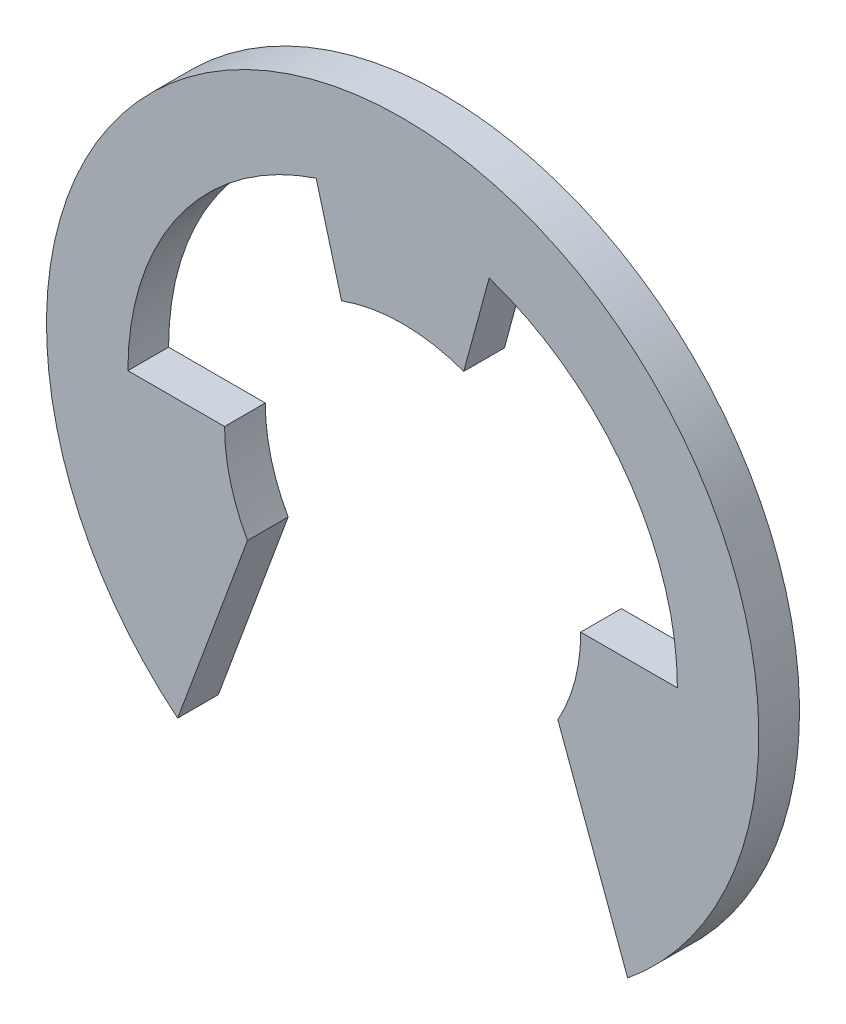
ISO-10303-21;
HEADER;
FILE_DESCRIPTION(('STEP AP214'),'2;1');
FILE_NAME('part.step','',(''),(''),'','','');
FILE_SCHEMA(('AUTOMOTIVE_DESIGN { 1 0 10303 214 1 1 1 1 }'));
ENDSEC;
DATA;
#1=APPLICATION_CONTEXT('core data for automotive mechanical design processes');
#2=APPLICATION_PROTOCOL_DEFINITION('international standard','automotive_design',2000,#1);
#3=PRODUCT_CONTEXT('',#1,'mechanical');
#4=PRODUCT('Part','Part','',(#3));
#5=PRODUCT_RELATED_PRODUCT_CATEGORY('part','',(#4));
#6=PRODUCT_DEFINITION_FORMATION('','',#4);
#7=PRODUCT_DEFINITION_CONTEXT('part definition',#1,'design');
#8=PRODUCT_DEFINITION('design','',#6,#7);
#9=PRODUCT_DEFINITION_SHAPE('','',#8);
#10=(LENGTH_UNIT() NAMED_UNIT(*) SI_UNIT(.MILLI.,.METRE.));
#11=(NAMED_UNIT(*) PLANE_ANGLE_UNIT() SI_UNIT($,.RADIAN.));
#12=(NAMED_UNIT(*) SI_UNIT($,.STERADIAN.) SOLID_ANGLE_UNIT());
#13=UNCERTAINTY_MEASURE_WITH_UNIT(LENGTH_MEASURE(1.E-05),#10,'distance_accuracy_value','');
#14=(GEOMETRIC_REPRESENTATION_CONTEXT(3) GLOBAL_UNCERTAINTY_ASSIGNED_CONTEXT((#13)) GLOBAL_UNIT_ASSIGNED_CONTEXT((#10,
#11,#12)) REPRESENTATION_CONTEXT('',''));
#15=CARTESIAN_POINT('',(0.,0.,0.));
#16=DIRECTION('',(0.,0.,1.));
#17=DIRECTION('',(1.,0.,0.));
#18=AXIS2_PLACEMENT_3D('',#15,#16,#17);
#19=CARTESIAN_POINT('',(-1.7,5.1254268114958,0.4));
#20=DIRECTION('',(0.965016494472312,0.262189178640864,0.));
#21=DIRECTION('',(0.,0.,-1.));
#22=AXIS2_PLACEMENT_3D('',#19,#20,#21);
#23=PLANE('',#22);
#24=DIRECTION('',(0.262189178640864,-0.965016494472312,0.));
#25=VECTOR('',#24,1.);
#26=CARTESIAN_POINT('',(-1.7,5.1254268114958,-0.4));
#27=LINE('',#26,#25);
#28=CARTESIAN_POINT('',(-1.7,5.1254268114958,-0.4));
#29=VERTEX_POINT('',#28);
#30=CARTESIAN_POINT('',(-1.20067611436934,3.28760959792719,-0.4));
#31=VERTEX_POINT('',#30);
#32=EDGE_CURVE('E173',#29,#31,#27,.T.);
#33=ORIENTED_EDGE('',*,*,#32,.T.);
#34=DIRECTION('',(0.,0.,-1.));
#35=VECTOR('',#34,1.);
#36=CARTESIAN_POINT('',(-1.20067611436934,3.28760959792719,0.4));
#37=LINE('',#36,#35);
#38=CARTESIAN_POINT('',(-1.20067611436934,3.28760959792719,0.4));
#39=VERTEX_POINT('',#38);
#40=EDGE_CURVE('E203',#39,#31,#37,.T.);
#41=ORIENTED_EDGE('',*,*,#40,.F.);
#42=DIRECTION('',(0.262189178640864,-0.965016494472312,0.));
#43=VECTOR('',#42,1.);
#44=CARTESIAN_POINT('',(-1.7,5.1254268114958,0.4));
#45=LINE('',#44,#43);
#46=CARTESIAN_POINT('',(-1.7,5.1254268114958,0.4));
#47=VERTEX_POINT('',#46);
#48=EDGE_CURVE('E236',#47,#39,#45,.T.);
#49=ORIENTED_EDGE('',*,*,#48,.F.);
#50=DIRECTION('',(0.,0.,-1.));
#51=VECTOR('',#50,1.);
#52=CARTESIAN_POINT('',(-1.7,5.1254268114958,0.4));
#53=LINE('',#52,#51);
#54=EDGE_CURVE('E9',#47,#29,#53,.T.);
#55=ORIENTED_EDGE('',*,*,#54,.T.);
#56=EDGE_LOOP('',(#33,#41,#49,#55));
#57=FACE_BOUND('',#56,.T.);
#58=ADVANCED_FACE('F14',(#57),#23,.F.);
#59=CARTESIAN_POINT('',(0.,0.,0.4));
#60=DIRECTION('',(0.,0.,1.));
#61=DIRECTION('',(-1.,0.,0.));
#62=AXIS2_PLACEMENT_3D('',#59,#60,#61);
#63=CYLINDRICAL_SURFACE('',#62,5.4);
#64=CARTESIAN_POINT('',(0.,0.,-0.4));
#65=DIRECTION('',(0.,0.,1.));
#66=DIRECTION('',(1.,0.,0.));
#67=AXIS2_PLACEMENT_3D('',#64,#65,#66);
#68=CIRCLE('',#67,5.4);
#69=CARTESIAN_POINT('',(-5.4,0.,-0.4));
#70=VERTEX_POINT('',#69);
#71=EDGE_CURVE('E153',#29,#70,#68,.T.);
#72=ORIENTED_EDGE('',*,*,#71,.F.);
#73=ORIENTED_EDGE('',*,*,#54,.F.);
#74=CARTESIAN_POINT('',(0.,0.,0.4));
#75=DIRECTION('',(0.,0.,1.));
#76=DIRECTION('',(1.,0.,0.));
#77=AXIS2_PLACEMENT_3D('',#74,#75,#76);
#78=CIRCLE('',#77,5.4);
#79=CARTESIAN_POINT('',(-5.4,0.,0.4));
#80=VERTEX_POINT('',#79);
#81=EDGE_CURVE('E156',#47,#80,#78,.T.);
#82=ORIENTED_EDGE('',*,*,#81,.T.);
#83=DIRECTION('',(0.,0.,-1.));
#84=VECTOR('',#83,1.);
#85=CARTESIAN_POINT('',(-5.4,0.,0.4));
#86=LINE('',#85,#84);
#87=EDGE_CURVE('E25',#80,#70,#86,.T.);
#88=ORIENTED_EDGE('',*,*,#87,.T.);
#89=EDGE_LOOP('',(#72,#73,#82,#88));
#90=FACE_BOUND('',#89,.T.);
#91=ADVANCED_FACE('F151',(#90),#63,.F.);
#92=CARTESIAN_POINT('',(-3.5,0.,0.4));
#93=DIRECTION('',(0.,-1.,0.));
#94=DIRECTION('',(0.,0.,-1.));
#95=AXIS2_PLACEMENT_3D('',#92,#93,#94);
#96=PLANE('',#95);
#97=DIRECTION('',(-1.,0.,0.));
#98=VECTOR('',#97,1.);
#99=CARTESIAN_POINT('',(-3.5,0.,-0.4));
#100=LINE('',#99,#98);
#101=CARTESIAN_POINT('',(-3.5,0.,-0.4));
#102=VERTEX_POINT('',#101);
#103=EDGE_CURVE('E164',#102,#70,#100,.T.);
#104=ORIENTED_EDGE('',*,*,#103,.T.);
#105=ORIENTED_EDGE('',*,*,#87,.F.);
#106=DIRECTION('',(-1.,0.,0.));
#107=VECTOR('',#106,1.);
#108=CARTESIAN_POINT('',(-3.5,0.,0.4));
#109=LINE('',#108,#107);
#110=CARTESIAN_POINT('',(-3.5,0.,0.4));
#111=VERTEX_POINT('',#110);
#112=EDGE_CURVE('E231',#111,#80,#109,.T.);
#113=ORIENTED_EDGE('',*,*,#112,.F.);
#114=DIRECTION('',(0.,0.,-1.));
#115=VECTOR('',#114,1.);
#116=CARTESIAN_POINT('',(-3.5,0.,0.4));
#117=LINE('',#116,#115);
#118=EDGE_CURVE('E161',#111,#102,#117,.T.);
#119=ORIENTED_EDGE('',*,*,#118,.T.);
#120=EDGE_LOOP('',(#104,#105,#113,#119));
#121=FACE_BOUND('',#120,.T.);
#122=ADVANCED_FACE('F165',(#121),#96,.F.);
#123=CARTESIAN_POINT('',(0.,0.,0.4));
#124=DIRECTION('',(0.,0.,1.));
#125=DIRECTION('',(-1.,0.,0.));
#126=AXIS2_PLACEMENT_3D('',#123,#124,#125);
#127=CYLINDRICAL_SURFACE('',#126,3.5);
#128=CARTESIAN_POINT('',(0.,0.,-0.4));
#129=DIRECTION('',(0.,0.,1.));
#130=DIRECTION('',(1.,0.,0.));
#131=AXIS2_PLACEMENT_3D('',#128,#129,#130);
#132=CIRCLE('',#131,3.5);
#133=CARTESIAN_POINT('',(-3.05,-1.71682847133894,-0.4));
#134=VERTEX_POINT('',#133);
#135=EDGE_CURVE('E168',#102,#134,#132,.T.);
#136=ORIENTED_EDGE('',*,*,#135,.F.);
#137=ORIENTED_EDGE('',*,*,#118,.F.);
#138=CARTESIAN_POINT('',(0.,0.,0.4));
#139=DIRECTION('',(0.,0.,1.));
#140=DIRECTION('',(1.,0.,0.));
#141=AXIS2_PLACEMENT_3D('',#138,#139,#140);
#142=CIRCLE('',#141,3.5);
#143=CARTESIAN_POINT('',(-3.05,-1.71682847133894,0.4));
#144=VERTEX_POINT('',#143);
#145=EDGE_CURVE('E211',#111,#144,#142,.T.);
#146=ORIENTED_EDGE('',*,*,#145,.T.);
#147=DIRECTION('',(0.,0.,-1.));
#148=VECTOR('',#147,1.);
#149=CARTESIAN_POINT('',(-3.05,-1.71682847133894,0.4));
#150=LINE('',#149,#148);
#151=EDGE_CURVE('E39',#144,#134,#150,.T.);
#152=ORIENTED_EDGE('',*,*,#151,.T.);
#153=EDGE_LOOP('',(#136,#137,#146,#152));
#154=FACE_BOUND('',#153,.T.);
#155=ADVANCED_FACE('F325',(#154),#127,.F.);
#156=CARTESIAN_POINT('',(-4.42216562373015,-5.42627415417792,0.4));
#157=DIRECTION('',(-0.937888934611898,0.346935651573256,0.));
#158=DIRECTION('',(0.,0.,1.));
#159=AXIS2_PLACEMENT_3D('',#156,#157,#158);
#160=PLANE('',#159);
#161=DIRECTION('',(0.346935651573256,0.937888934611898,0.));
#162=VECTOR('',#161,1.);
#163=CARTESIAN_POINT('',(-4.42216562373015,-5.42627415417792,-0.4));
#164=LINE('',#163,#162);
#165=CARTESIAN_POINT('',(-4.42216562373016,-5.42627415417792,-0.4));
#166=VERTEX_POINT('',#165);
#167=EDGE_CURVE('E184',#166,#134,#164,.T.);
#168=ORIENTED_EDGE('',*,*,#167,.T.);
#169=ORIENTED_EDGE('',*,*,#151,.F.);
#170=DIRECTION('',(0.346935651573256,0.937888934611898,0.));
#171=VECTOR('',#170,1.);
#172=CARTESIAN_POINT('',(-4.42216562373015,-5.42627415417792,0.4));
#173=LINE('',#172,#171);
#174=CARTESIAN_POINT('',(-4.42216562373016,-5.42627415417792,0.4));
#175=VERTEX_POINT('',#174);
#176=EDGE_CURVE('E207',#175,#144,#173,.T.);
#177=ORIENTED_EDGE('',*,*,#176,.F.);
#178=DIRECTION('',(0.,0.,-1.));
#179=VECTOR('',#178,1.);
#180=CARTESIAN_POINT('',(-4.42216562373016,-5.42627415417792,0.4));
#181=LINE('',#180,#179);
#182=EDGE_CURVE('E18',#175,#166,#181,.T.);
#183=ORIENTED_EDGE('',*,*,#182,.T.);
#184=EDGE_LOOP('',(#168,#169,#177,#183));
#185=FACE_BOUND('',#184,.T.);
#186=ADVANCED_FACE('F326',(#185),#160,.F.);
#187=CARTESIAN_POINT('',(0.,0.,-0.4));
#188=DIRECTION('',(0.,0.,1.));
#189=DIRECTION('',(1.,0.,0.));
#190=AXIS2_PLACEMENT_3D('',#187,#188,#189);
#191=PLANE('',#190);
#192=DIRECTION('',(0.346935651573255,-0.937888934611898,0.));
#193=VECTOR('',#192,1.);
#194=CARTESIAN_POINT('',(3.05,-1.71682847133893,-0.4));
#195=LINE('',#194,#193);
#196=CARTESIAN_POINT('',(3.05,-1.71682847133894,-0.4));
#197=VERTEX_POINT('',#196);
#198=CARTESIAN_POINT('',(4.42216562373015,-5.42627415417792,-0.4));
#199=VERTEX_POINT('',#198);
#200=EDGE_CURVE('E196',#197,#199,#195,.T.);
#201=ORIENTED_EDGE('',*,*,#200,.F.);
#202=CARTESIAN_POINT('',(0.,0.,-0.4));
#203=DIRECTION('',(0.,0.,1.));
#204=DIRECTION('',(1.,0.,0.));
#205=AXIS2_PLACEMENT_3D('',#202,#203,#204);
#206=CIRCLE('',#205,3.5);
#207=CARTESIAN_POINT('',(3.5,0.,-0.4));
#208=VERTEX_POINT('',#207);
#209=EDGE_CURVE('E190',#197,#208,#206,.T.);
#210=ORIENTED_EDGE('',*,*,#209,.T.);
#211=DIRECTION('',(-1.,0.,0.));
#212=VECTOR('',#211,1.);
#213=CARTESIAN_POINT('',(5.4,0.,-0.4));
#214=LINE('',#213,#212);
#215=CARTESIAN_POINT('',(5.4,0.,-0.4));
#216=VERTEX_POINT('',#215);
#217=EDGE_CURVE('E134',#216,#208,#214,.T.);
#218=ORIENTED_EDGE('',*,*,#217,.F.);
#219=CARTESIAN_POINT('',(0.,0.,-0.4));
#220=DIRECTION('',(0.,0.,1.));
#221=DIRECTION('',(1.,0.,0.));
#222=AXIS2_PLACEMENT_3D('',#219,#220,#221);
#223=CIRCLE('',#222,5.4);
#224=CARTESIAN_POINT('',(1.7,5.1254268114958,-0.4));
#225=VERTEX_POINT('',#224);
#226=EDGE_CURVE('E100',#216,#225,#223,.T.);
#227=ORIENTED_EDGE('',*,*,#226,.T.);
#228=DIRECTION('',(0.262189178640865,0.965016494472312,0.));
#229=VECTOR('',#228,1.);
#230=CARTESIAN_POINT('',(1.20067611436934,3.28760959792719,-0.4));
#231=LINE('',#230,#229);
#232=CARTESIAN_POINT('',(1.20067611436934,3.28760959792719,-0.4));
#233=VERTEX_POINT('',#232);
#234=EDGE_CURVE('E213',#233,#225,#231,.T.);
#235=ORIENTED_EDGE('',*,*,#234,.F.);
#236=CARTESIAN_POINT('',(0.,0.,-0.4));
#237=DIRECTION('',(0.,0.,1.));
#238=DIRECTION('',(1.,0.,0.));
#239=AXIS2_PLACEMENT_3D('',#236,#237,#238);
#240=CIRCLE('',#239,3.5);
#241=EDGE_CURVE('E89',#233,#31,#240,.T.);
#242=ORIENTED_EDGE('',*,*,#241,.T.);
#243=ORIENTED_EDGE('',*,*,#32,.F.);
#244=ORIENTED_EDGE('',*,*,#71,.T.);
#245=ORIENTED_EDGE('',*,*,#103,.F.);
#246=ORIENTED_EDGE('',*,*,#135,.T.);
#247=ORIENTED_EDGE('',*,*,#167,.F.);
#248=CARTESIAN_POINT('',(0.,0.,-0.4));
#249=DIRECTION('',(0.,0.,1.));
#250=DIRECTION('',(1.,0.,0.));
#251=AXIS2_PLACEMENT_3D('',#248,#249,#250);
#252=CIRCLE('',#251,7.);
#253=EDGE_CURVE('E269',#199,#166,#252,.T.);
#254=ORIENTED_EDGE('',*,*,#253,.F.);
#255=EDGE_LOOP('',(#201,#210,#218,#227,#235,#242,#243,#244,#245,#246,#247,#254));
#256=FACE_BOUND('',#255,.T.);
#257=ADVANCED_FACE('F171',(#256),#191,.F.);
#258=CARTESIAN_POINT('',(5.4,0.,0.4));
#259=DIRECTION('',(0.,-1.,0.));
#260=DIRECTION('',(0.,0.,-1.));
#261=AXIS2_PLACEMENT_3D('',#258,#259,#260);
#262=PLANE('',#261);
#263=ORIENTED_EDGE('',*,*,#217,.T.);
#264=DIRECTION('',(0.,0.,-1.));
#265=VECTOR('',#264,1.);
#266=CARTESIAN_POINT('',(3.5,0.,0.4));
#267=LINE('',#266,#265);
#268=CARTESIAN_POINT('',(3.5,0.,0.4));
#269=VERTEX_POINT('',#268);
#270=EDGE_CURVE('E212',#269,#208,#267,.T.);
#271=ORIENTED_EDGE('',*,*,#270,.F.);
#272=DIRECTION('',(-1.,0.,0.));
#273=VECTOR('',#272,1.);
#274=CARTESIAN_POINT('',(5.4,0.,0.4));
#275=LINE('',#274,#273);
#276=CARTESIAN_POINT('',(5.4,0.,0.4));
#277=VERTEX_POINT('',#276);
#278=EDGE_CURVE('E234',#277,#269,#275,.T.);
#279=ORIENTED_EDGE('',*,*,#278,.F.);
#280=DIRECTION('',(0.,0.,-1.));
#281=VECTOR('',#280,1.);
#282=CARTESIAN_POINT('',(5.4,0.,0.4));
#283=LINE('',#282,#281);
#284=EDGE_CURVE('E228',#277,#216,#283,.T.);
#285=ORIENTED_EDGE('',*,*,#284,.T.);
#286=EDGE_LOOP('',(#263,#271,#279,#285));
#287=FACE_BOUND('',#286,.T.);
#288=ADVANCED_FACE('F16',(#287),#262,.F.);
#289=CARTESIAN_POINT('',(0.,0.,0.4));
#290=DIRECTION('',(0.,0.,1.));
#291=DIRECTION('',(1.,0.,0.));
#292=AXIS2_PLACEMENT_3D('',#289,#290,#291);
#293=PLANE('',#292);
#294=DIRECTION('',(0.346935651573255,-0.937888934611898,0.));
#295=VECTOR('',#294,1.);
#296=CARTESIAN_POINT('',(3.05,-1.71682847133893,0.4));
#297=LINE('',#296,#295);
#298=CARTESIAN_POINT('',(3.05,-1.71682847133894,0.4));
#299=VERTEX_POINT('',#298);
#300=CARTESIAN_POINT('',(4.42216562373015,-5.42627415417792,0.4));
#301=VERTEX_POINT('',#300);
#302=EDGE_CURVE('E195',#299,#301,#297,.T.);
#303=ORIENTED_EDGE('',*,*,#302,.T.);
#304=CARTESIAN_POINT('',(0.,0.,0.4));
#305=DIRECTION('',(0.,0.,1.));
#306=DIRECTION('',(1.,0.,0.));
#307=AXIS2_PLACEMENT_3D('',#304,#305,#306);
#308=CIRCLE('',#307,7.);
#309=EDGE_CURVE('E186',#301,#175,#308,.T.);
#310=ORIENTED_EDGE('',*,*,#309,.T.);
#311=ORIENTED_EDGE('',*,*,#176,.T.);
#312=ORIENTED_EDGE('',*,*,#145,.F.);
#313=ORIENTED_EDGE('',*,*,#112,.T.);
#314=ORIENTED_EDGE('',*,*,#81,.F.);
#315=ORIENTED_EDGE('',*,*,#48,.T.);
#316=CARTESIAN_POINT('',(0.,0.,0.4));
#317=DIRECTION('',(0.,0.,1.));
#318=DIRECTION('',(1.,0.,0.));
#319=AXIS2_PLACEMENT_3D('',#316,#317,#318);
#320=CIRCLE('',#319,3.5);
#321=CARTESIAN_POINT('',(1.20067611436934,3.28760959792719,0.4));
#322=VERTEX_POINT('',#321);
#323=EDGE_CURVE('E125',#322,#39,#320,.T.);
#324=ORIENTED_EDGE('',*,*,#323,.F.);
#325=DIRECTION('',(0.262189178640865,0.965016494472312,0.));
#326=VECTOR('',#325,1.);
#327=CARTESIAN_POINT('',(1.20067611436934,3.28760959792719,0.4));
#328=LINE('',#327,#326);
#329=CARTESIAN_POINT('',(1.7,5.1254268114958,0.4));
#330=VERTEX_POINT('',#329);
#331=EDGE_CURVE('E200',#322,#330,#328,.T.);
#332=ORIENTED_EDGE('',*,*,#331,.T.);
#333=CARTESIAN_POINT('',(0.,0.,0.4));
#334=DIRECTION('',(0.,0.,1.));
#335=DIRECTION('',(1.,0.,0.));
#336=AXIS2_PLACEMENT_3D('',#333,#334,#335);
#337=CIRCLE('',#336,5.4);
#338=EDGE_CURVE('E225',#277,#330,#337,.T.);
#339=ORIENTED_EDGE('',*,*,#338,.F.);
#340=ORIENTED_EDGE('',*,*,#278,.T.);
#341=CARTESIAN_POINT('',(0.,0.,0.4));
#342=DIRECTION('',(0.,0.,1.));
#343=DIRECTION('',(1.,0.,0.));
#344=AXIS2_PLACEMENT_3D('',#341,#342,#343);
#345=CIRCLE('',#344,3.5);
#346=EDGE_CURVE('E221',#299,#269,#345,.T.);
#347=ORIENTED_EDGE('',*,*,#346,.F.);
#348=EDGE_LOOP('',(#303,#310,#311,#312,#313,#314,#315,#324,#332,#339,#340,#347));
#349=FACE_BOUND('',#348,.T.);
#350=ADVANCED_FACE('F286',(#349),#293,.T.);
#351=CARTESIAN_POINT('',(0.,0.,0.4));
#352=DIRECTION('',(0.,0.,1.));
#353=DIRECTION('',(-1.,0.,0.));
#354=AXIS2_PLACEMENT_3D('',#351,#352,#353);
#355=CYLINDRICAL_SURFACE('',#354,3.5);
#356=ORIENTED_EDGE('',*,*,#209,.F.);
#357=DIRECTION('',(0.,0.,-1.));
#358=VECTOR('',#357,1.);
#359=CARTESIAN_POINT('',(3.05,-1.71682847133894,0.4));
#360=LINE('',#359,#358);
#361=EDGE_CURVE('E260',#299,#197,#360,.T.);
#362=ORIENTED_EDGE('',*,*,#361,.F.);
#363=ORIENTED_EDGE('',*,*,#346,.T.);
#364=ORIENTED_EDGE('',*,*,#270,.T.);
#365=EDGE_LOOP('',(#356,#362,#363,#364));
#366=FACE_BOUND('',#365,.T.);
#367=ADVANCED_FACE('F289',(#366),#355,.F.);
#368=CARTESIAN_POINT('',(0.,0.,0.4));
#369=DIRECTION('',(0.,0.,1.));
#370=DIRECTION('',(-1.,0.,0.));
#371=AXIS2_PLACEMENT_3D('',#368,#369,#370);
#372=CYLINDRICAL_SURFACE('',#371,7.);
#373=ORIENTED_EDGE('',*,*,#253,.T.);
#374=ORIENTED_EDGE('',*,*,#182,.F.);
#375=ORIENTED_EDGE('',*,*,#309,.F.);
#376=DIRECTION('',(0.,0.,-1.));
#377=VECTOR('',#376,1.);
#378=CARTESIAN_POINT('',(4.42216562373015,-5.42627415417792,0.4));
#379=LINE('',#378,#377);
#380=EDGE_CURVE('E191',#301,#199,#379,.T.);
#381=ORIENTED_EDGE('',*,*,#380,.T.);
#382=EDGE_LOOP('',(#373,#374,#375,#381));
#383=FACE_BOUND('',#382,.T.);
#384=ADVANCED_FACE('F285',(#383),#372,.T.);
#385=CARTESIAN_POINT('',(3.05,-1.71682847133893,0.4));
#386=DIRECTION('',(0.937888934611898,0.346935651573254,0.));
#387=DIRECTION('',(0.,0.,-1.));
#388=AXIS2_PLACEMENT_3D('',#385,#386,#387);
#389=PLANE('',#388);
#390=ORIENTED_EDGE('',*,*,#200,.T.);
#391=ORIENTED_EDGE('',*,*,#380,.F.);
#392=ORIENTED_EDGE('',*,*,#302,.F.);
#393=ORIENTED_EDGE('',*,*,#361,.T.);
#394=EDGE_LOOP('',(#390,#391,#392,#393));
#395=FACE_BOUND('',#394,.T.);
#396=ADVANCED_FACE('F279',(#395),#389,.F.);
#397=CARTESIAN_POINT('',(0.,0.,0.4));
#398=DIRECTION('',(0.,0.,1.));
#399=DIRECTION('',(-1.,0.,0.));
#400=AXIS2_PLACEMENT_3D('',#397,#398,#399);
#401=CYLINDRICAL_SURFACE('',#400,3.5);
#402=ORIENTED_EDGE('',*,*,#241,.F.);
#403=DIRECTION('',(0.,0.,-1.));
#404=VECTOR('',#403,1.);
#405=CARTESIAN_POINT('',(1.20067611436934,3.28760959792719,0.4));
#406=LINE('',#405,#404);
#407=EDGE_CURVE('E197',#322,#233,#406,.T.);
#408=ORIENTED_EDGE('',*,*,#407,.F.);
#409=ORIENTED_EDGE('',*,*,#323,.T.);
#410=ORIENTED_EDGE('',*,*,#40,.T.);
#411=EDGE_LOOP('',(#402,#408,#409,#410));
#412=FACE_BOUND('',#411,.T.);
#413=ADVANCED_FACE('F303',(#412),#401,.F.);
#414=CARTESIAN_POINT('',(0.,0.,0.4));
#415=DIRECTION('',(0.,0.,1.));
#416=DIRECTION('',(-1.,0.,0.));
#417=AXIS2_PLACEMENT_3D('',#414,#415,#416);
#418=CYLINDRICAL_SURFACE('',#417,5.4);
#419=ORIENTED_EDGE('',*,*,#226,.F.);
#420=ORIENTED_EDGE('',*,*,#284,.F.);
#421=ORIENTED_EDGE('',*,*,#338,.T.);
#422=DIRECTION('',(0.,0.,-1.));
#423=VECTOR('',#422,1.);
#424=CARTESIAN_POINT('',(1.7,5.1254268114958,0.4));
#425=LINE('',#424,#423);
#426=EDGE_CURVE('E206',#330,#225,#425,.T.);
#427=ORIENTED_EDGE('',*,*,#426,.T.);
#428=EDGE_LOOP('',(#419,#420,#421,#427));
#429=FACE_BOUND('',#428,.T.);
#430=ADVANCED_FACE('F293',(#429),#418,.F.);
#431=CARTESIAN_POINT('',(1.20067611436934,3.28760959792719,0.4));
#432=DIRECTION('',(-0.965016494472311,0.262189178640865,0.));
#433=DIRECTION('',(0.,0.,1.));
#434=AXIS2_PLACEMENT_3D('',#431,#432,#433);
#435=PLANE('',#434);
#436=ORIENTED_EDGE('',*,*,#234,.T.);
#437=ORIENTED_EDGE('',*,*,#426,.F.);
#438=ORIENTED_EDGE('',*,*,#331,.F.);
#439=ORIENTED_EDGE('',*,*,#407,.T.);
#440=EDGE_LOOP('',(#436,#437,#438,#439));
#441=FACE_BOUND('',#440,.T.);
#442=ADVANCED_FACE('F295',(#441),#435,.F.);
#443=CLOSED_SHELL('',(#58,#91,#122,#155,#186,#257,#288,#350,#367,#384,#396,#413,#430,#442));
#444=MANIFOLD_SOLID_BREP('B1',#443);
#445=ADVANCED_BREP_SHAPE_REPRESENTATION('',(#18,#444),#14);
#446=SHAPE_DEFINITION_REPRESENTATION(#9,#445);
ENDSEC;
END-ISO-10303-21;
